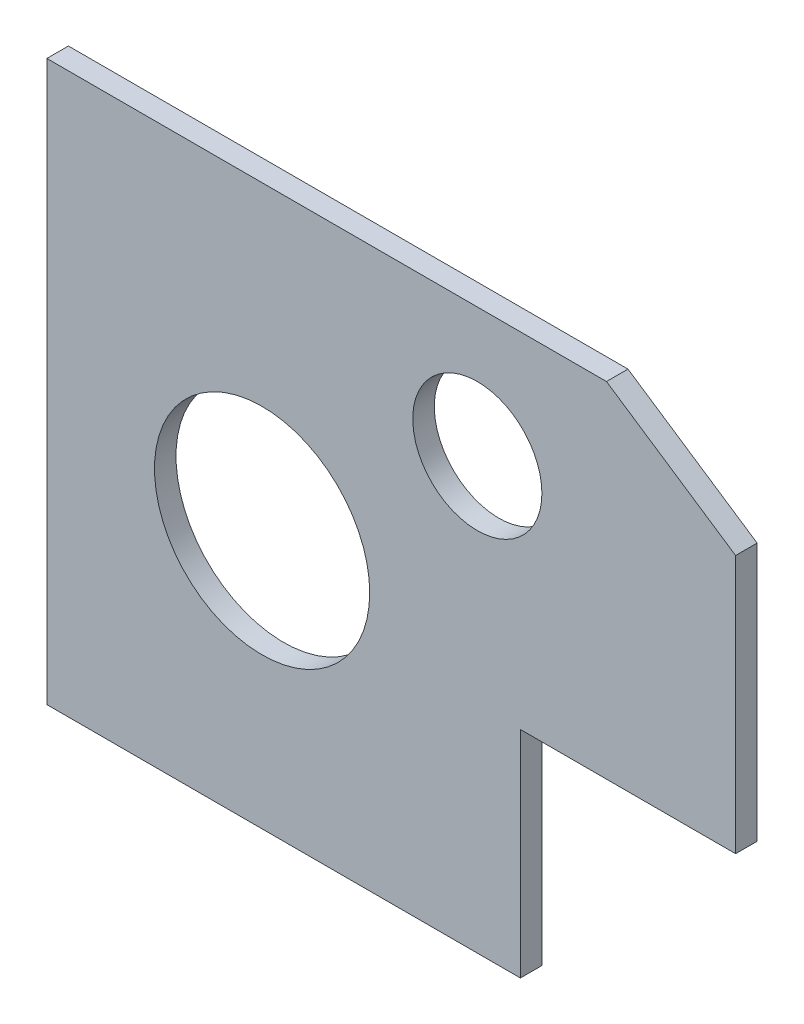
ISO-10303-21;
HEADER;
FILE_DESCRIPTION(('STEP AP214'),'2;1');
FILE_NAME('part.step','',(''),(''),'','','');
FILE_SCHEMA(('AUTOMOTIVE_DESIGN { 1 0 10303 214 1 1 1 1 }'));
ENDSEC;
DATA;
#1=APPLICATION_CONTEXT('core data for automotive mechanical design processes');
#2=APPLICATION_PROTOCOL_DEFINITION('international standard','automotive_design',2000,#1);
#3=PRODUCT_CONTEXT('',#1,'mechanical');
#4=PRODUCT('Part','Part','',(#3));
#5=PRODUCT_RELATED_PRODUCT_CATEGORY('part','',(#4));
#6=PRODUCT_DEFINITION_FORMATION('','',#4);
#7=PRODUCT_DEFINITION_CONTEXT('part definition',#1,'design');
#8=PRODUCT_DEFINITION('design','',#6,#7);
#9=PRODUCT_DEFINITION_SHAPE('','',#8);
#10=(LENGTH_UNIT() NAMED_UNIT(*) SI_UNIT(.MILLI.,.METRE.));
#11=(NAMED_UNIT(*) PLANE_ANGLE_UNIT() SI_UNIT($,.RADIAN.));
#12=(NAMED_UNIT(*) SI_UNIT($,.STERADIAN.) SOLID_ANGLE_UNIT());
#13=UNCERTAINTY_MEASURE_WITH_UNIT(LENGTH_MEASURE(1.E-05),#10,'distance_accuracy_value','');
#14=(GEOMETRIC_REPRESENTATION_CONTEXT(3) GLOBAL_UNCERTAINTY_ASSIGNED_CONTEXT((#13)) GLOBAL_UNIT_ASSIGNED_CONTEXT((#10,
#11,#12)) REPRESENTATION_CONTEXT('',''));
#15=CARTESIAN_POINT('',(0.,0.,0.));
#16=DIRECTION('',(0.,0.,1.));
#17=DIRECTION('',(1.,0.,0.));
#18=AXIS2_PLACEMENT_3D('',#15,#16,#17);
#19=CARTESIAN_POINT('',(0.,0.,6.35));
#20=DIRECTION('',(0.,0.,1.));
#21=DIRECTION('',(1.,0.,0.));
#22=AXIS2_PLACEMENT_3D('',#19,#20,#21);
#23=PLANE('',#22);
#24=CARTESIAN_POINT('',(63.5,76.2,6.35));
#25=DIRECTION('',(0.,0.,1.));
#26=DIRECTION('',(1.,0.,0.));
#27=AXIS2_PLACEMENT_3D('',#24,#25,#26);
#28=CIRCLE('',#27,31.75);
#29=CARTESIAN_POINT('',(95.25,76.2,6.35));
#30=VERTEX_POINT('',#29);
#31=EDGE_CURVE('E140',#30,#30,#28,.T.);
#32=ORIENTED_EDGE('',*,*,#31,.F.);
#33=EDGE_LOOP('',(#32));
#34=FACE_BOUND('',#33,.T.);
#35=DIRECTION('',(1.,0.,0.));
#36=VECTOR('',#35,1.);
#37=CARTESIAN_POINT('',(0.,0.,6.35));
#38=LINE('',#37,#36);
#39=CARTESIAN_POINT('',(0.,0.,6.35));
#40=VERTEX_POINT('',#39);
#41=CARTESIAN_POINT('',(139.7,0.,6.35));
#42=VERTEX_POINT('',#41);
#43=EDGE_CURVE('E155',#40,#42,#38,.T.);
#44=ORIENTED_EDGE('',*,*,#43,.T.);
#45=DIRECTION('',(0.,1.,0.));
#46=VECTOR('',#45,1.);
#47=CARTESIAN_POINT('',(139.7,0.,6.35));
#48=LINE('',#47,#46);
#49=CARTESIAN_POINT('',(139.7,63.5,6.35));
#50=VERTEX_POINT('',#49);
#51=EDGE_CURVE('E97',#42,#50,#48,.T.);
#52=ORIENTED_EDGE('',*,*,#51,.T.);
#53=DIRECTION('',(1.,0.,0.));
#54=VECTOR('',#53,1.);
#55=CARTESIAN_POINT('',(139.7,63.5,6.35));
#56=LINE('',#55,#54);
#57=CARTESIAN_POINT('',(203.2,63.5,6.35));
#58=VERTEX_POINT('',#57);
#59=EDGE_CURVE('E172',#50,#58,#56,.T.);
#60=ORIENTED_EDGE('',*,*,#59,.T.);
#61=DIRECTION('',(0.,1.,0.));
#62=VECTOR('',#61,1.);
#63=CARTESIAN_POINT('',(203.2,63.5,6.35));
#64=LINE('',#63,#62);
#65=CARTESIAN_POINT('',(203.2,139.7,6.35));
#66=VERTEX_POINT('',#65);
#67=EDGE_CURVE('E113',#58,#66,#64,.T.);
#68=ORIENTED_EDGE('',*,*,#67,.T.);
#69=DIRECTION('',(-0.832050294337844,0.554700196225229,0.));
#70=VECTOR('',#69,1.);
#71=CARTESIAN_POINT('',(203.2,139.7,6.35));
#72=LINE('',#71,#70);
#73=CARTESIAN_POINT('',(165.1,165.1,6.35));
#74=VERTEX_POINT('',#73);
#75=EDGE_CURVE('E107',#66,#74,#72,.T.);
#76=ORIENTED_EDGE('',*,*,#75,.T.);
#77=DIRECTION('',(-1.,0.,0.));
#78=VECTOR('',#77,1.);
#79=CARTESIAN_POINT('',(0.,165.1,6.35));
#80=LINE('',#79,#78);
#81=CARTESIAN_POINT('',(0.,165.1,6.35));
#82=VERTEX_POINT('',#81);
#83=EDGE_CURVE('E111',#74,#82,#80,.T.);
#84=ORIENTED_EDGE('',*,*,#83,.T.);
#85=DIRECTION('',(0.,-1.,0.));
#86=VECTOR('',#85,1.);
#87=CARTESIAN_POINT('',(0.,0.,6.35));
#88=LINE('',#87,#86);
#89=EDGE_CURVE('E57',#82,#40,#88,.T.);
#90=ORIENTED_EDGE('',*,*,#89,.T.);
#91=EDGE_LOOP('',(#44,#52,#60,#68,#76,#84,#90));
#92=FACE_BOUND('',#91,.T.);
#93=CARTESIAN_POINT('',(127.,127.,6.35));
#94=DIRECTION('',(0.,0.,1.));
#95=DIRECTION('',(1.,0.,0.));
#96=AXIS2_PLACEMENT_3D('',#93,#94,#95);
#97=CIRCLE('',#96,19.05);
#98=CARTESIAN_POINT('',(146.05,127.,6.35));
#99=VERTEX_POINT('',#98);
#100=EDGE_CURVE('E192',#99,#99,#97,.T.);
#101=ORIENTED_EDGE('',*,*,#100,.F.);
#102=EDGE_LOOP('',(#101));
#103=FACE_BOUND('',#102,.T.);
#104=ADVANCED_FACE('F39',(#34,#92,#103),#23,.T.);
#105=CARTESIAN_POINT('',(0.,0.,0.));
#106=DIRECTION('',(0.,0.,1.));
#107=DIRECTION('',(1.,0.,0.));
#108=AXIS2_PLACEMENT_3D('',#105,#106,#107);
#109=PLANE('',#108);
#110=DIRECTION('',(1.,0.,0.));
#111=VECTOR('',#110,1.);
#112=CARTESIAN_POINT('',(0.,0.,0.));
#113=LINE('',#112,#111);
#114=CARTESIAN_POINT('',(0.,0.,0.));
#115=VERTEX_POINT('',#114);
#116=CARTESIAN_POINT('',(139.7,0.,0.));
#117=VERTEX_POINT('',#116);
#118=EDGE_CURVE('E135',#115,#117,#113,.T.);
#119=ORIENTED_EDGE('',*,*,#118,.F.);
#120=DIRECTION('',(0.,-1.,0.));
#121=VECTOR('',#120,1.);
#122=CARTESIAN_POINT('',(0.,0.,0.));
#123=LINE('',#122,#121);
#124=CARTESIAN_POINT('',(0.,165.1,0.));
#125=VERTEX_POINT('',#124);
#126=EDGE_CURVE('E89',#125,#115,#123,.T.);
#127=ORIENTED_EDGE('',*,*,#126,.F.);
#128=DIRECTION('',(-1.,0.,0.));
#129=VECTOR('',#128,1.);
#130=CARTESIAN_POINT('',(0.,165.1,0.));
#131=LINE('',#130,#129);
#132=CARTESIAN_POINT('',(165.1,165.1,0.));
#133=VERTEX_POINT('',#132);
#134=EDGE_CURVE('E83',#133,#125,#131,.T.);
#135=ORIENTED_EDGE('',*,*,#134,.F.);
#136=DIRECTION('',(-0.832050294337844,0.554700196225229,0.));
#137=VECTOR('',#136,1.);
#138=CARTESIAN_POINT('',(203.2,139.7,0.));
#139=LINE('',#138,#137);
#140=CARTESIAN_POINT('',(203.2,139.7,0.));
#141=VERTEX_POINT('',#140);
#142=EDGE_CURVE('E122',#141,#133,#139,.T.);
#143=ORIENTED_EDGE('',*,*,#142,.F.);
#144=DIRECTION('',(0.,1.,0.));
#145=VECTOR('',#144,1.);
#146=CARTESIAN_POINT('',(203.2,63.5,0.));
#147=LINE('',#146,#145);
#148=CARTESIAN_POINT('',(203.2,63.5,0.));
#149=VERTEX_POINT('',#148);
#150=EDGE_CURVE('E146',#149,#141,#147,.T.);
#151=ORIENTED_EDGE('',*,*,#150,.F.);
#152=DIRECTION('',(1.,0.,0.));
#153=VECTOR('',#152,1.);
#154=CARTESIAN_POINT('',(139.7,63.5,0.));
#155=LINE('',#154,#153);
#156=CARTESIAN_POINT('',(139.7,63.5,0.));
#157=VERTEX_POINT('',#156);
#158=EDGE_CURVE('E143',#157,#149,#155,.T.);
#159=ORIENTED_EDGE('',*,*,#158,.F.);
#160=DIRECTION('',(0.,1.,0.));
#161=VECTOR('',#160,1.);
#162=CARTESIAN_POINT('',(139.7,0.,0.));
#163=LINE('',#162,#161);
#164=EDGE_CURVE('E139',#117,#157,#163,.T.);
#165=ORIENTED_EDGE('',*,*,#164,.F.);
#166=EDGE_LOOP('',(#119,#127,#135,#143,#151,#159,#165));
#167=FACE_BOUND('',#166,.T.);
#168=CARTESIAN_POINT('',(63.5,76.2,0.));
#169=DIRECTION('',(0.,0.,1.));
#170=DIRECTION('',(1.,0.,0.));
#171=AXIS2_PLACEMENT_3D('',#168,#169,#170);
#172=CIRCLE('',#171,31.75);
#173=CARTESIAN_POINT('',(95.25,76.2,0.));
#174=VERTEX_POINT('',#173);
#175=EDGE_CURVE('E188',#174,#174,#172,.T.);
#176=ORIENTED_EDGE('',*,*,#175,.T.);
#177=EDGE_LOOP('',(#176));
#178=FACE_BOUND('',#177,.T.);
#179=CARTESIAN_POINT('',(127.,127.,0.));
#180=DIRECTION('',(0.,0.,1.));
#181=DIRECTION('',(1.,0.,0.));
#182=AXIS2_PLACEMENT_3D('',#179,#180,#181);
#183=CIRCLE('',#182,19.05);
#184=CARTESIAN_POINT('',(146.05,127.,0.));
#185=VERTEX_POINT('',#184);
#186=EDGE_CURVE('E196',#185,#185,#183,.T.);
#187=ORIENTED_EDGE('',*,*,#186,.T.);
#188=EDGE_LOOP('',(#187));
#189=FACE_BOUND('',#188,.T.);
#190=ADVANCED_FACE('F176',(#167,#178,#189),#109,.F.);
#191=CARTESIAN_POINT('',(0.,0.,6.35));
#192=DIRECTION('',(0.,1.,0.));
#193=DIRECTION('',(0.,0.,1.));
#194=AXIS2_PLACEMENT_3D('',#191,#192,#193);
#195=PLANE('',#194);
#196=ORIENTED_EDGE('',*,*,#118,.T.);
#197=DIRECTION('',(0.,0.,-1.));
#198=VECTOR('',#197,1.);
#199=CARTESIAN_POINT('',(139.7,0.,6.35));
#200=LINE('',#199,#198);
#201=EDGE_CURVE('E11',#42,#117,#200,.T.);
#202=ORIENTED_EDGE('',*,*,#201,.F.);
#203=ORIENTED_EDGE('',*,*,#43,.F.);
#204=DIRECTION('',(0.,0.,-1.));
#205=VECTOR('',#204,1.);
#206=CARTESIAN_POINT('',(0.,0.,6.35));
#207=LINE('',#206,#205);
#208=EDGE_CURVE('E131',#40,#115,#207,.T.);
#209=ORIENTED_EDGE('',*,*,#208,.T.);
#210=EDGE_LOOP('',(#196,#202,#203,#209));
#211=FACE_BOUND('',#210,.T.);
#212=ADVANCED_FACE('F41',(#211),#195,.F.);
#213=CARTESIAN_POINT('',(139.7,0.,6.35));
#214=DIRECTION('',(-1.,0.,0.));
#215=DIRECTION('',(0.,0.,1.));
#216=AXIS2_PLACEMENT_3D('',#213,#214,#215);
#217=PLANE('',#216);
#218=ORIENTED_EDGE('',*,*,#164,.T.);
#219=DIRECTION('',(0.,0.,-1.));
#220=VECTOR('',#219,1.);
#221=CARTESIAN_POINT('',(139.7,63.5,6.35));
#222=LINE('',#221,#220);
#223=EDGE_CURVE('E49',#50,#157,#222,.T.);
#224=ORIENTED_EDGE('',*,*,#223,.F.);
#225=ORIENTED_EDGE('',*,*,#51,.F.);
#226=ORIENTED_EDGE('',*,*,#201,.T.);
#227=EDGE_LOOP('',(#218,#224,#225,#226));
#228=FACE_BOUND('',#227,.T.);
#229=ADVANCED_FACE('F228',(#228),#217,.F.);
#230=CARTESIAN_POINT('',(139.7,63.5,6.35));
#231=DIRECTION('',(0.,1.,0.));
#232=DIRECTION('',(0.,0.,1.));
#233=AXIS2_PLACEMENT_3D('',#230,#231,#232);
#234=PLANE('',#233);
#235=ORIENTED_EDGE('',*,*,#158,.T.);
#236=DIRECTION('',(0.,0.,-1.));
#237=VECTOR('',#236,1.);
#238=CARTESIAN_POINT('',(203.2,63.5,6.35));
#239=LINE('',#238,#237);
#240=EDGE_CURVE('E162',#58,#149,#239,.T.);
#241=ORIENTED_EDGE('',*,*,#240,.F.);
#242=ORIENTED_EDGE('',*,*,#59,.F.);
#243=ORIENTED_EDGE('',*,*,#223,.T.);
#244=EDGE_LOOP('',(#235,#241,#242,#243));
#245=FACE_BOUND('',#244,.T.);
#246=ADVANCED_FACE('F170',(#245),#234,.F.);
#247=CARTESIAN_POINT('',(203.2,63.5,6.35));
#248=DIRECTION('',(-1.,0.,0.));
#249=DIRECTION('',(0.,0.,1.));
#250=AXIS2_PLACEMENT_3D('',#247,#248,#249);
#251=PLANE('',#250);
#252=ORIENTED_EDGE('',*,*,#150,.T.);
#253=DIRECTION('',(0.,0.,-1.));
#254=VECTOR('',#253,1.);
#255=CARTESIAN_POINT('',(203.2,139.7,6.35));
#256=LINE('',#255,#254);
#257=EDGE_CURVE('E124',#66,#141,#256,.T.);
#258=ORIENTED_EDGE('',*,*,#257,.F.);
#259=ORIENTED_EDGE('',*,*,#67,.F.);
#260=ORIENTED_EDGE('',*,*,#240,.T.);
#261=EDGE_LOOP('',(#252,#258,#259,#260));
#262=FACE_BOUND('',#261,.T.);
#263=ADVANCED_FACE('F179',(#262),#251,.F.);
#264=CARTESIAN_POINT('',(203.2,139.7,6.35));
#265=DIRECTION('',(-0.554700196225229,-0.832050294337844,0.));
#266=DIRECTION('',(0.832050294337844,-0.554700196225229,0.));
#267=AXIS2_PLACEMENT_3D('',#264,#265,#266);
#268=PLANE('',#267);
#269=ORIENTED_EDGE('',*,*,#142,.T.);
#270=DIRECTION('',(0.,0.,-1.));
#271=VECTOR('',#270,1.);
#272=CARTESIAN_POINT('',(165.1,165.1,6.35));
#273=LINE('',#272,#271);
#274=EDGE_CURVE('E119',#74,#133,#273,.T.);
#275=ORIENTED_EDGE('',*,*,#274,.F.);
#276=ORIENTED_EDGE('',*,*,#75,.F.);
#277=ORIENTED_EDGE('',*,*,#257,.T.);
#278=EDGE_LOOP('',(#269,#275,#276,#277));
#279=FACE_BOUND('',#278,.T.);
#280=ADVANCED_FACE('F120',(#279),#268,.F.);
#281=CARTESIAN_POINT('',(0.,165.1,6.35));
#282=DIRECTION('',(0.,-1.,0.));
#283=DIRECTION('',(0.,0.,-1.));
#284=AXIS2_PLACEMENT_3D('',#281,#282,#283);
#285=PLANE('',#284);
#286=ORIENTED_EDGE('',*,*,#134,.T.);
#287=DIRECTION('',(0.,0.,-1.));
#288=VECTOR('',#287,1.);
#289=CARTESIAN_POINT('',(0.,165.1,6.35));
#290=LINE('',#289,#288);
#291=EDGE_CURVE('E125',#82,#125,#290,.T.);
#292=ORIENTED_EDGE('',*,*,#291,.F.);
#293=ORIENTED_EDGE('',*,*,#83,.F.);
#294=ORIENTED_EDGE('',*,*,#274,.T.);
#295=EDGE_LOOP('',(#286,#292,#293,#294));
#296=FACE_BOUND('',#295,.T.);
#297=ADVANCED_FACE('F127',(#296),#285,.F.);
#298=CARTESIAN_POINT('',(0.,0.,6.35));
#299=DIRECTION('',(1.,0.,0.));
#300=DIRECTION('',(0.,1.,0.));
#301=AXIS2_PLACEMENT_3D('',#298,#299,#300);
#302=PLANE('',#301);
#303=ORIENTED_EDGE('',*,*,#126,.T.);
#304=ORIENTED_EDGE('',*,*,#208,.F.);
#305=ORIENTED_EDGE('',*,*,#89,.F.);
#306=ORIENTED_EDGE('',*,*,#291,.T.);
#307=EDGE_LOOP('',(#303,#304,#305,#306));
#308=FACE_BOUND('',#307,.T.);
#309=ADVANCED_FACE('F218',(#308),#302,.F.);
#310=CARTESIAN_POINT('',(63.5,76.2,6.35));
#311=DIRECTION('',(0.,0.,-1.));
#312=DIRECTION('',(-1.,0.,0.));
#313=AXIS2_PLACEMENT_3D('',#310,#311,#312);
#314=CYLINDRICAL_SURFACE('',#313,31.75);
#315=ORIENTED_EDGE('',*,*,#31,.T.);
#316=EDGE_LOOP('',(#315));
#317=FACE_BOUND('',#316,.T.);
#318=ORIENTED_EDGE('',*,*,#175,.F.);
#319=EDGE_LOOP('',(#318));
#320=FACE_BOUND('',#319,.T.);
#321=ADVANCED_FACE('F215',(#317,#320),#314,.F.);
#322=CARTESIAN_POINT('',(127.,127.,6.35));
#323=DIRECTION('',(0.,0.,-1.));
#324=DIRECTION('',(-1.,0.,0.));
#325=AXIS2_PLACEMENT_3D('',#322,#323,#324);
#326=CYLINDRICAL_SURFACE('',#325,19.05);
#327=ORIENTED_EDGE('',*,*,#100,.T.);
#328=EDGE_LOOP('',(#327));
#329=FACE_BOUND('',#328,.T.);
#330=ORIENTED_EDGE('',*,*,#186,.F.);
#331=EDGE_LOOP('',(#330));
#332=FACE_BOUND('',#331,.T.);
#333=ADVANCED_FACE('F204',(#329,#332),#326,.F.);
#334=CLOSED_SHELL('',(#104,#190,#212,#229,#246,#263,#280,#297,#309,#321,#333));
#335=MANIFOLD_SOLID_BREP('B2',#334);
#336=ADVANCED_BREP_SHAPE_REPRESENTATION('',(#18,#335),#14);
#337=SHAPE_DEFINITION_REPRESENTATION(#9,#336);
ENDSEC;
END-ISO-10303-21;
